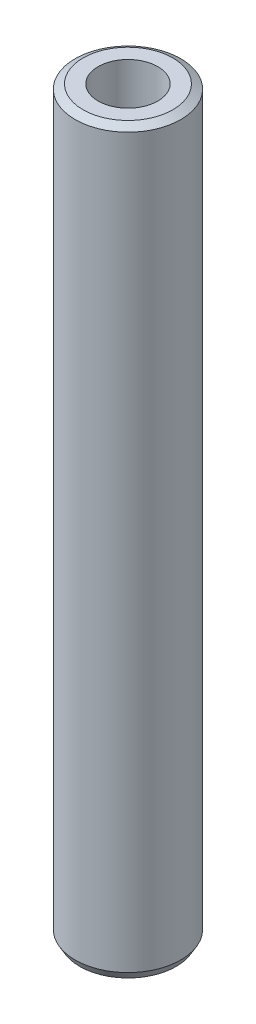
ISO-10303-21;
HEADER;
FILE_DESCRIPTION(('STEP AP214'),'2;1');
FILE_NAME('part.step','',(''),(''),'','','');
FILE_SCHEMA(('AUTOMOTIVE_DESIGN { 1 0 10303 214 1 1 1 1 }'));
ENDSEC;
DATA;
#1=APPLICATION_CONTEXT('core data for automotive mechanical design processes');
#2=APPLICATION_PROTOCOL_DEFINITION('international standard','automotive_design',2000,#1);
#3=PRODUCT_CONTEXT('',#1,'mechanical');
#4=PRODUCT('Part','Part','',(#3));
#5=PRODUCT_RELATED_PRODUCT_CATEGORY('part','',(#4));
#6=PRODUCT_DEFINITION_FORMATION('','',#4);
#7=PRODUCT_DEFINITION_CONTEXT('part definition',#1,'design');
#8=PRODUCT_DEFINITION('design','',#6,#7);
#9=PRODUCT_DEFINITION_SHAPE('','',#8);
#10=(LENGTH_UNIT() NAMED_UNIT(*) SI_UNIT(.MILLI.,.METRE.));
#11=(NAMED_UNIT(*) PLANE_ANGLE_UNIT() SI_UNIT($,.RADIAN.));
#12=(NAMED_UNIT(*) SI_UNIT($,.STERADIAN.) SOLID_ANGLE_UNIT());
#13=UNCERTAINTY_MEASURE_WITH_UNIT(LENGTH_MEASURE(1.E-05),#10,'distance_accuracy_value','');
#14=(GEOMETRIC_REPRESENTATION_CONTEXT(3) GLOBAL_UNCERTAINTY_ASSIGNED_CONTEXT((#13)) GLOBAL_UNIT_ASSIGNED_CONTEXT((#10,
#11,#12)) REPRESENTATION_CONTEXT('',''));
#15=CARTESIAN_POINT('',(0.,0.,0.));
#16=DIRECTION('',(0.,0.,1.));
#17=DIRECTION('',(1.,0.,0.));
#18=AXIS2_PLACEMENT_3D('',#15,#16,#17);
#19=CARTESIAN_POINT('',(0.,525.698947026522,0.));
#20=DIRECTION('',(0.,-1.,0.));
#21=DIRECTION('',(0.,0.,-1.));
#22=AXIS2_PLACEMENT_3D('',#19,#20,#21);
#23=CYLINDRICAL_SURFACE('',#22,37.5);
#24=CARTESIAN_POINT('',(0.,522.456330274541,0.));
#25=DIRECTION('',(0.,1.,0.));
#26=DIRECTION('',(0.,0.,1.));
#27=AXIS2_PLACEMENT_3D('',#24,#25,#26);
#28=CIRCLE('',#27,37.5);
#29=CARTESIAN_POINT('',(0.,522.456330274541,37.5));
#30=VERTEX_POINT('',#29);
#31=EDGE_CURVE('E50',#30,#30,#28,.F.);
#32=ORIENTED_EDGE('',*,*,#31,.T.);
#33=EDGE_LOOP('',(#32));
#34=FACE_BOUND('',#33,.T.);
#35=CARTESIAN_POINT('',(0.,5.61637696390638,0.));
#36=DIRECTION('',(0.,1.,0.));
#37=DIRECTION('',(0.,0.,1.));
#38=AXIS2_PLACEMENT_3D('',#35,#36,#37);
#39=CIRCLE('',#38,37.5);
#40=CARTESIAN_POINT('',(0.,5.61637696390638,37.5));
#41=VERTEX_POINT('',#40);
#42=EDGE_CURVE('E51',#41,#41,#39,.T.);
#43=ORIENTED_EDGE('',*,*,#42,.T.);
#44=EDGE_LOOP('',(#43));
#45=FACE_BOUND('',#44,.T.);
#46=ADVANCED_FACE('F39',(#34,#45),#23,.T.);
#47=CARTESIAN_POINT('',(0.,525.698947026522,0.));
#48=DIRECTION('',(0.,1.,0.));
#49=DIRECTION('',(0.,0.,1.));
#50=AXIS2_PLACEMENT_3D('',#47,#48,#49);
#51=PLANE('',#50);
#52=CARTESIAN_POINT('',(0.,525.698947026522,0.));
#53=DIRECTION('',(0.,1.,0.));
#54=DIRECTION('',(0.,0.,1.));
#55=AXIS2_PLACEMENT_3D('',#52,#53,#54);
#56=CIRCLE('',#55,31.883623036094);
#57=CARTESIAN_POINT('',(0.,525.698947026522,31.883623036094));
#58=VERTEX_POINT('',#57);
#59=EDGE_CURVE('E54',#58,#58,#56,.T.);
#60=ORIENTED_EDGE('',*,*,#59,.T.);
#61=EDGE_LOOP('',(#60));
#62=FACE_BOUND('',#61,.T.);
#63=CARTESIAN_POINT('',(0.,525.698947026522,0.));
#64=DIRECTION('',(0.,1.,0.));
#65=DIRECTION('',(0.,0.,1.));
#66=AXIS2_PLACEMENT_3D('',#63,#64,#65);
#67=CIRCLE('',#66,21.1974304276435);
#68=CARTESIAN_POINT('',(0.,525.698947026522,21.1974304276435));
#69=VERTEX_POINT('',#68);
#70=EDGE_CURVE('E58',#69,#69,#67,.T.);
#71=ORIENTED_EDGE('',*,*,#70,.F.);
#72=EDGE_LOOP('',(#71));
#73=FACE_BOUND('',#72,.T.);
#74=ADVANCED_FACE('F69',(#62,#73),#51,.T.);
#75=CARTESIAN_POINT('',(0.,0.,0.));
#76=DIRECTION('',(0.,1.,0.));
#77=DIRECTION('',(0.,0.,1.));
#78=AXIS2_PLACEMENT_3D('',#75,#76,#77);
#79=PLANE('',#78);
#80=CARTESIAN_POINT('',(0.,0.,0.));
#81=DIRECTION('',(0.,1.,0.));
#82=DIRECTION('',(0.,0.,1.));
#83=AXIS2_PLACEMENT_3D('',#80,#81,#82);
#84=CIRCLE('',#83,34.2573832480182);
#85=CARTESIAN_POINT('',(0.,0.,34.2573832480182));
#86=VERTEX_POINT('',#85);
#87=EDGE_CURVE('E10',#86,#86,#84,.F.);
#88=ORIENTED_EDGE('',*,*,#87,.T.);
#89=EDGE_LOOP('',(#88));
#90=FACE_BOUND('',#89,.T.);
#91=CARTESIAN_POINT('',(0.,0.,0.));
#92=DIRECTION('',(0.,1.,0.));
#93=DIRECTION('',(0.,0.,1.));
#94=AXIS2_PLACEMENT_3D('',#91,#92,#93);
#95=CIRCLE('',#94,21.1974304276435);
#96=CARTESIAN_POINT('',(0.,0.,21.1974304276435));
#97=VERTEX_POINT('',#96);
#98=EDGE_CURVE('E63',#97,#97,#95,.T.);
#99=ORIENTED_EDGE('',*,*,#98,.T.);
#100=EDGE_LOOP('',(#99));
#101=FACE_BOUND('',#100,.T.);
#102=ADVANCED_FACE('F75',(#90,#101),#79,.F.);
#103=CARTESIAN_POINT('',(0.,525.698947026522,0.));
#104=DIRECTION('',(0.,-1.,0.));
#105=DIRECTION('',(0.,0.,-1.));
#106=AXIS2_PLACEMENT_3D('',#103,#104,#105);
#107=CYLINDRICAL_SURFACE('',#106,21.1974304276435);
#108=ORIENTED_EDGE('',*,*,#70,.T.);
#109=EDGE_LOOP('',(#108));
#110=FACE_BOUND('',#109,.T.);
#111=ORIENTED_EDGE('',*,*,#98,.F.);
#112=EDGE_LOOP('',(#111));
#113=FACE_BOUND('',#112,.T.);
#114=ADVANCED_FACE('F70',(#110,#113),#107,.F.);
#115=CARTESIAN_POINT('',(0.,525.698947026522,0.));
#116=DIRECTION('',(0.,-1.,0.));
#117=DIRECTION('',(0.,0.,-1.));
#118=AXIS2_PLACEMENT_3D('',#115,#116,#117);
#119=CONICAL_SURFACE('',#118,31.883623036094,1.0471975511966);
#120=ORIENTED_EDGE('',*,*,#31,.F.);
#121=EDGE_LOOP('',(#120));
#122=FACE_BOUND('',#121,.T.);
#123=ORIENTED_EDGE('',*,*,#59,.F.);
#124=EDGE_LOOP('',(#123));
#125=FACE_BOUND('',#124,.T.);
#126=ADVANCED_FACE('F81',(#122,#125),#119,.T.);
#127=CARTESIAN_POINT('',(0.,5.61637696390638,0.));
#128=DIRECTION('',(0.,1.,0.));
#129=DIRECTION('',(0.,0.,1.));
#130=AXIS2_PLACEMENT_3D('',#127,#128,#129);
#131=CONICAL_SURFACE('',#130,37.5,0.523598775598302);
#132=ORIENTED_EDGE('',*,*,#87,.F.);
#133=EDGE_LOOP('',(#132));
#134=FACE_BOUND('',#133,.T.);
#135=ORIENTED_EDGE('',*,*,#42,.F.);
#136=EDGE_LOOP('',(#135));
#137=FACE_BOUND('',#136,.T.);
#138=ADVANCED_FACE('F45',(#134,#137),#131,.T.);
#139=CLOSED_SHELL('',(#46,#74,#102,#114,#126,#138));
#140=MANIFOLD_SOLID_BREP('B2',#139);
#141=ADVANCED_BREP_SHAPE_REPRESENTATION('',(#18,#140),#14);
#142=SHAPE_DEFINITION_REPRESENTATION(#9,#141);
ENDSEC;
END-ISO-10303-21;
